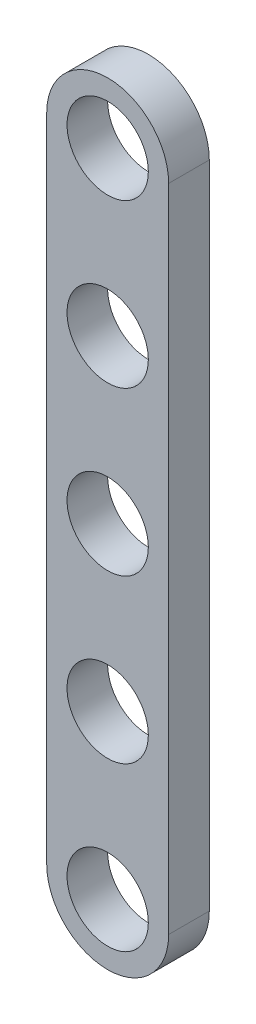
ISO-10303-21;
HEADER;
FILE_DESCRIPTION(('STEP AP214'),'2;1');
FILE_NAME('part.step','',(''),(''),'','','');
FILE_SCHEMA(('AUTOMOTIVE_DESIGN { 1 0 10303 214 1 1 1 1 }'));
ENDSEC;
DATA;
#1=APPLICATION_CONTEXT('core data for automotive mechanical design processes');
#2=APPLICATION_PROTOCOL_DEFINITION('international standard','automotive_design',2000,#1);
#3=PRODUCT_CONTEXT('',#1,'mechanical');
#4=PRODUCT('Part','Part','',(#3));
#5=PRODUCT_RELATED_PRODUCT_CATEGORY('part','',(#4));
#6=PRODUCT_DEFINITION_FORMATION('','',#4);
#7=PRODUCT_DEFINITION_CONTEXT('part definition',#1,'design');
#8=PRODUCT_DEFINITION('design','',#6,#7);
#9=PRODUCT_DEFINITION_SHAPE('','',#8);
#10=(LENGTH_UNIT() NAMED_UNIT(*) SI_UNIT(.MILLI.,.METRE.));
#11=(NAMED_UNIT(*) PLANE_ANGLE_UNIT() SI_UNIT($,.RADIAN.));
#12=(NAMED_UNIT(*) SI_UNIT($,.STERADIAN.) SOLID_ANGLE_UNIT());
#13=UNCERTAINTY_MEASURE_WITH_UNIT(LENGTH_MEASURE(1.E-05),#10,'distance_accuracy_value','');
#14=(GEOMETRIC_REPRESENTATION_CONTEXT(3) GLOBAL_UNCERTAINTY_ASSIGNED_CONTEXT((#13)) GLOBAL_UNIT_ASSIGNED_CONTEXT((#10,
#11,#12)) REPRESENTATION_CONTEXT('',''));
#15=CARTESIAN_POINT('',(0.,0.,0.));
#16=DIRECTION('',(0.,0.,1.));
#17=DIRECTION('',(1.,0.,0.));
#18=AXIS2_PLACEMENT_3D('',#15,#16,#17);
#19=CARTESIAN_POINT('',(0.,0.,1.));
#20=DIRECTION('',(0.,0.,1.));
#21=DIRECTION('',(1.,0.,0.));
#22=AXIS2_PLACEMENT_3D('',#19,#20,#21);
#23=PLANE('',#22);
#24=CARTESIAN_POINT('',(0.,0.,1.));
#25=DIRECTION('',(0.,0.,1.));
#26=DIRECTION('',(1.,0.,0.));
#27=AXIS2_PLACEMENT_3D('',#24,#25,#26);
#28=CIRCLE('',#27,1.);
#29=CARTESIAN_POINT('',(1.,0.,1.));
#30=VERTEX_POINT('',#29);
#31=EDGE_CURVE('E128',#30,#30,#28,.T.);
#32=ORIENTED_EDGE('',*,*,#31,.F.);
#33=EDGE_LOOP('',(#32));
#34=FACE_BOUND('',#33,.T.);
#35=CARTESIAN_POINT('',(0.,8.,1.));
#36=DIRECTION('',(0.,0.,1.));
#37=DIRECTION('',(1.,0.,0.));
#38=AXIS2_PLACEMENT_3D('',#35,#36,#37);
#39=CIRCLE('',#38,1.);
#40=CARTESIAN_POINT('',(1.,8.,1.));
#41=VERTEX_POINT('',#40);
#42=EDGE_CURVE('E116',#41,#41,#39,.T.);
#43=ORIENTED_EDGE('',*,*,#42,.F.);
#44=EDGE_LOOP('',(#43));
#45=FACE_BOUND('',#44,.T.);
#46=CARTESIAN_POINT('',(0.,0.,1.));
#47=DIRECTION('',(0.,0.,1.));
#48=DIRECTION('',(1.,0.,0.));
#49=AXIS2_PLACEMENT_3D('',#46,#47,#48);
#50=CIRCLE('',#49,1.5);
#51=CARTESIAN_POINT('',(-1.5,0.,1.));
#52=VERTEX_POINT('',#51);
#53=CARTESIAN_POINT('',(1.5,0.,1.));
#54=VERTEX_POINT('',#53);
#55=EDGE_CURVE('E86',#52,#54,#50,.T.);
#56=ORIENTED_EDGE('',*,*,#55,.T.);
#57=DIRECTION('',(0.,1.,0.));
#58=VECTOR('',#57,1.);
#59=CARTESIAN_POINT('',(1.5,0.,1.));
#60=LINE('',#59,#58);
#61=CARTESIAN_POINT('',(1.5,16.,1.));
#62=VERTEX_POINT('',#61);
#63=EDGE_CURVE('E81',#54,#62,#60,.T.);
#64=ORIENTED_EDGE('',*,*,#63,.T.);
#65=CARTESIAN_POINT('',(0.,16.,1.));
#66=DIRECTION('',(0.,0.,1.));
#67=DIRECTION('',(1.,0.,0.));
#68=AXIS2_PLACEMENT_3D('',#65,#66,#67);
#69=CIRCLE('',#68,1.5);
#70=CARTESIAN_POINT('',(-1.5,16.,1.));
#71=VERTEX_POINT('',#70);
#72=EDGE_CURVE('E84',#62,#71,#69,.T.);
#73=ORIENTED_EDGE('',*,*,#72,.T.);
#74=DIRECTION('',(0.,-1.,0.));
#75=VECTOR('',#74,1.);
#76=CARTESIAN_POINT('',(-1.5,0.,1.));
#77=LINE('',#76,#75);
#78=EDGE_CURVE('E51',#71,#52,#77,.T.);
#79=ORIENTED_EDGE('',*,*,#78,.T.);
#80=EDGE_LOOP('',(#56,#64,#73,#79));
#81=FACE_BOUND('',#80,.T.);
#82=CARTESIAN_POINT('',(0.,16.,1.));
#83=DIRECTION('',(0.,0.,1.));
#84=DIRECTION('',(1.,0.,0.));
#85=AXIS2_PLACEMENT_3D('',#82,#83,#84);
#86=CIRCLE('',#85,1.);
#87=CARTESIAN_POINT('',(1.,16.,1.));
#88=VERTEX_POINT('',#87);
#89=EDGE_CURVE('E101',#88,#88,#86,.T.);
#90=ORIENTED_EDGE('',*,*,#89,.F.);
#91=EDGE_LOOP('',(#90));
#92=FACE_BOUND('',#91,.T.);
#93=CARTESIAN_POINT('',(0.,12.,1.));
#94=DIRECTION('',(0.,0.,1.));
#95=DIRECTION('',(1.,0.,0.));
#96=AXIS2_PLACEMENT_3D('',#93,#94,#95);
#97=CIRCLE('',#96,1.);
#98=CARTESIAN_POINT('',(1.,12.,1.));
#99=VERTEX_POINT('',#98);
#100=EDGE_CURVE('E122',#99,#99,#97,.T.);
#101=ORIENTED_EDGE('',*,*,#100,.F.);
#102=EDGE_LOOP('',(#101));
#103=FACE_BOUND('',#102,.T.);
#104=CARTESIAN_POINT('',(0.,4.,1.));
#105=DIRECTION('',(0.,0.,1.));
#106=DIRECTION('',(1.,0.,0.));
#107=AXIS2_PLACEMENT_3D('',#104,#105,#106);
#108=CIRCLE('',#107,1.);
#109=CARTESIAN_POINT('',(1.,4.,1.));
#110=VERTEX_POINT('',#109);
#111=EDGE_CURVE('E134',#110,#110,#108,.T.);
#112=ORIENTED_EDGE('',*,*,#111,.F.);
#113=EDGE_LOOP('',(#112));
#114=FACE_BOUND('',#113,.T.);
#115=ADVANCED_FACE('F34',(#34,#45,#81,#92,#103,#114),#23,.T.);
#116=CARTESIAN_POINT('',(0.,0.,0.));
#117=DIRECTION('',(0.,0.,1.));
#118=DIRECTION('',(1.,0.,0.));
#119=AXIS2_PLACEMENT_3D('',#116,#117,#118);
#120=PLANE('',#119);
#121=CARTESIAN_POINT('',(0.,0.,0.));
#122=DIRECTION('',(0.,0.,1.));
#123=DIRECTION('',(1.,0.,0.));
#124=AXIS2_PLACEMENT_3D('',#121,#122,#123);
#125=CIRCLE('',#124,1.5);
#126=CARTESIAN_POINT('',(-1.5,0.,0.));
#127=VERTEX_POINT('',#126);
#128=CARTESIAN_POINT('',(1.5,0.,0.));
#129=VERTEX_POINT('',#128);
#130=EDGE_CURVE('E98',#127,#129,#125,.T.);
#131=ORIENTED_EDGE('',*,*,#130,.F.);
#132=DIRECTION('',(0.,-1.,0.));
#133=VECTOR('',#132,1.);
#134=CARTESIAN_POINT('',(-1.5,0.,0.));
#135=LINE('',#134,#133);
#136=CARTESIAN_POINT('',(-1.5,16.,0.));
#137=VERTEX_POINT('',#136);
#138=EDGE_CURVE('E74',#137,#127,#135,.T.);
#139=ORIENTED_EDGE('',*,*,#138,.F.);
#140=CARTESIAN_POINT('',(0.,16.,0.));
#141=DIRECTION('',(0.,0.,1.));
#142=DIRECTION('',(1.,0.,0.));
#143=AXIS2_PLACEMENT_3D('',#140,#141,#142);
#144=CIRCLE('',#143,1.5);
#145=CARTESIAN_POINT('',(1.5,16.,0.));
#146=VERTEX_POINT('',#145);
#147=EDGE_CURVE('E68',#146,#137,#144,.T.);
#148=ORIENTED_EDGE('',*,*,#147,.F.);
#149=DIRECTION('',(0.,1.,0.));
#150=VECTOR('',#149,1.);
#151=CARTESIAN_POINT('',(1.5,0.,0.));
#152=LINE('',#151,#150);
#153=EDGE_CURVE('E90',#129,#146,#152,.T.);
#154=ORIENTED_EDGE('',*,*,#153,.F.);
#155=EDGE_LOOP('',(#131,#139,#148,#154));
#156=FACE_BOUND('',#155,.T.);
#157=CARTESIAN_POINT('',(0.,16.,0.));
#158=DIRECTION('',(0.,0.,1.));
#159=DIRECTION('',(1.,0.,0.));
#160=AXIS2_PLACEMENT_3D('',#157,#158,#159);
#161=CIRCLE('',#160,1.);
#162=CARTESIAN_POINT('',(1.,16.,0.));
#163=VERTEX_POINT('',#162);
#164=EDGE_CURVE('E113',#163,#163,#161,.T.);
#165=ORIENTED_EDGE('',*,*,#164,.T.);
#166=EDGE_LOOP('',(#165));
#167=FACE_BOUND('',#166,.T.);
#168=CARTESIAN_POINT('',(0.,8.,0.));
#169=DIRECTION('',(0.,0.,1.));
#170=DIRECTION('',(1.,0.,0.));
#171=AXIS2_PLACEMENT_3D('',#168,#169,#170);
#172=CIRCLE('',#171,1.);
#173=CARTESIAN_POINT('',(1.,8.,0.));
#174=VERTEX_POINT('',#173);
#175=EDGE_CURVE('E119',#174,#174,#172,.T.);
#176=ORIENTED_EDGE('',*,*,#175,.T.);
#177=EDGE_LOOP('',(#176));
#178=FACE_BOUND('',#177,.T.);
#179=CARTESIAN_POINT('',(0.,12.,0.));
#180=DIRECTION('',(0.,0.,1.));
#181=DIRECTION('',(1.,0.,0.));
#182=AXIS2_PLACEMENT_3D('',#179,#180,#181);
#183=CIRCLE('',#182,1.);
#184=CARTESIAN_POINT('',(1.,12.,0.));
#185=VERTEX_POINT('',#184);
#186=EDGE_CURVE('E125',#185,#185,#183,.T.);
#187=ORIENTED_EDGE('',*,*,#186,.T.);
#188=EDGE_LOOP('',(#187));
#189=FACE_BOUND('',#188,.T.);
#190=CARTESIAN_POINT('',(0.,0.,0.));
#191=DIRECTION('',(0.,0.,1.));
#192=DIRECTION('',(1.,0.,0.));
#193=AXIS2_PLACEMENT_3D('',#190,#191,#192);
#194=CIRCLE('',#193,1.);
#195=CARTESIAN_POINT('',(1.,0.,0.));
#196=VERTEX_POINT('',#195);
#197=EDGE_CURVE('E131',#196,#196,#194,.T.);
#198=ORIENTED_EDGE('',*,*,#197,.T.);
#199=EDGE_LOOP('',(#198));
#200=FACE_BOUND('',#199,.T.);
#201=CARTESIAN_POINT('',(0.,4.,0.));
#202=DIRECTION('',(0.,0.,1.));
#203=DIRECTION('',(1.,0.,0.));
#204=AXIS2_PLACEMENT_3D('',#201,#202,#203);
#205=CIRCLE('',#204,1.);
#206=CARTESIAN_POINT('',(1.,4.,0.));
#207=VERTEX_POINT('',#206);
#208=EDGE_CURVE('E137',#207,#207,#205,.T.);
#209=ORIENTED_EDGE('',*,*,#208,.T.);
#210=EDGE_LOOP('',(#209));
#211=FACE_BOUND('',#210,.T.);
#212=ADVANCED_FACE('F109',(#156,#167,#178,#189,#200,#211),#120,.F.);
#213=CARTESIAN_POINT('',(0.,0.,1.));
#214=DIRECTION('',(0.,0.,-1.));
#215=DIRECTION('',(-1.,0.,0.));
#216=AXIS2_PLACEMENT_3D('',#213,#214,#215);
#217=CYLINDRICAL_SURFACE('',#216,1.5);
#218=ORIENTED_EDGE('',*,*,#130,.T.);
#219=DIRECTION('',(0.,0.,-1.));
#220=VECTOR('',#219,1.);
#221=CARTESIAN_POINT('',(1.5,0.,1.));
#222=LINE('',#221,#220);
#223=EDGE_CURVE('E11',#54,#129,#222,.T.);
#224=ORIENTED_EDGE('',*,*,#223,.F.);
#225=ORIENTED_EDGE('',*,*,#55,.F.);
#226=DIRECTION('',(0.,0.,-1.));
#227=VECTOR('',#226,1.);
#228=CARTESIAN_POINT('',(-1.5,0.,1.));
#229=LINE('',#228,#227);
#230=EDGE_CURVE('E94',#52,#127,#229,.T.);
#231=ORIENTED_EDGE('',*,*,#230,.T.);
#232=EDGE_LOOP('',(#218,#224,#225,#231));
#233=FACE_BOUND('',#232,.T.);
#234=ADVANCED_FACE('F36',(#233),#217,.T.);
#235=CARTESIAN_POINT('',(1.5,0.,1.));
#236=DIRECTION('',(-1.,0.,0.));
#237=DIRECTION('',(0.,0.,1.));
#238=AXIS2_PLACEMENT_3D('',#235,#236,#237);
#239=PLANE('',#238);
#240=ORIENTED_EDGE('',*,*,#153,.T.);
#241=DIRECTION('',(0.,0.,-1.));
#242=VECTOR('',#241,1.);
#243=CARTESIAN_POINT('',(1.5,16.,1.));
#244=LINE('',#243,#242);
#245=EDGE_CURVE('E43',#62,#146,#244,.T.);
#246=ORIENTED_EDGE('',*,*,#245,.F.);
#247=ORIENTED_EDGE('',*,*,#63,.F.);
#248=ORIENTED_EDGE('',*,*,#223,.T.);
#249=EDGE_LOOP('',(#240,#246,#247,#248));
#250=FACE_BOUND('',#249,.T.);
#251=ADVANCED_FACE('F89',(#250),#239,.F.);
#252=CARTESIAN_POINT('',(0.,16.,1.));
#253=DIRECTION('',(0.,0.,-1.));
#254=DIRECTION('',(-1.,0.,0.));
#255=AXIS2_PLACEMENT_3D('',#252,#253,#254);
#256=CYLINDRICAL_SURFACE('',#255,1.5);
#257=ORIENTED_EDGE('',*,*,#147,.T.);
#258=DIRECTION('',(0.,0.,-1.));
#259=VECTOR('',#258,1.);
#260=CARTESIAN_POINT('',(-1.5,16.,1.));
#261=LINE('',#260,#259);
#262=EDGE_CURVE('E91',#71,#137,#261,.T.);
#263=ORIENTED_EDGE('',*,*,#262,.F.);
#264=ORIENTED_EDGE('',*,*,#72,.F.);
#265=ORIENTED_EDGE('',*,*,#245,.T.);
#266=EDGE_LOOP('',(#257,#263,#264,#265));
#267=FACE_BOUND('',#266,.T.);
#268=ADVANCED_FACE('F92',(#267),#256,.T.);
#269=CARTESIAN_POINT('',(-1.5,0.,1.));
#270=DIRECTION('',(1.,0.,0.));
#271=DIRECTION('',(0.,0.,-1.));
#272=AXIS2_PLACEMENT_3D('',#269,#270,#271);
#273=PLANE('',#272);
#274=ORIENTED_EDGE('',*,*,#138,.T.);
#275=ORIENTED_EDGE('',*,*,#230,.F.);
#276=ORIENTED_EDGE('',*,*,#78,.F.);
#277=ORIENTED_EDGE('',*,*,#262,.T.);
#278=EDGE_LOOP('',(#274,#275,#276,#277));
#279=FACE_BOUND('',#278,.T.);
#280=ADVANCED_FACE('F106',(#279),#273,.F.);
#281=CARTESIAN_POINT('',(0.,16.,1.));
#282=DIRECTION('',(0.,0.,-1.));
#283=DIRECTION('',(-1.,0.,0.));
#284=AXIS2_PLACEMENT_3D('',#281,#282,#283);
#285=CYLINDRICAL_SURFACE('',#284,1.);
#286=ORIENTED_EDGE('',*,*,#89,.T.);
#287=EDGE_LOOP('',(#286));
#288=FACE_BOUND('',#287,.T.);
#289=ORIENTED_EDGE('',*,*,#164,.F.);
#290=EDGE_LOOP('',(#289));
#291=FACE_BOUND('',#290,.T.);
#292=ADVANCED_FACE('F156',(#288,#291),#285,.F.);
#293=CARTESIAN_POINT('',(0.,8.,1.));
#294=DIRECTION('',(0.,0.,-1.));
#295=DIRECTION('',(-1.,0.,0.));
#296=AXIS2_PLACEMENT_3D('',#293,#294,#295);
#297=CYLINDRICAL_SURFACE('',#296,1.);
#298=ORIENTED_EDGE('',*,*,#42,.T.);
#299=EDGE_LOOP('',(#298));
#300=FACE_BOUND('',#299,.T.);
#301=ORIENTED_EDGE('',*,*,#175,.F.);
#302=EDGE_LOOP('',(#301));
#303=FACE_BOUND('',#302,.T.);
#304=ADVANCED_FACE('F202',(#300,#303),#297,.F.);
#305=CARTESIAN_POINT('',(0.,12.,1.));
#306=DIRECTION('',(0.,0.,-1.));
#307=DIRECTION('',(-1.,0.,0.));
#308=AXIS2_PLACEMENT_3D('',#305,#306,#307);
#309=CYLINDRICAL_SURFACE('',#308,1.);
#310=ORIENTED_EDGE('',*,*,#100,.T.);
#311=EDGE_LOOP('',(#310));
#312=FACE_BOUND('',#311,.T.);
#313=ORIENTED_EDGE('',*,*,#186,.F.);
#314=EDGE_LOOP('',(#313));
#315=FACE_BOUND('',#314,.T.);
#316=ADVANCED_FACE('F210',(#312,#315),#309,.F.);
#317=CARTESIAN_POINT('',(0.,0.,1.));
#318=DIRECTION('',(0.,0.,-1.));
#319=DIRECTION('',(-1.,0.,0.));
#320=AXIS2_PLACEMENT_3D('',#317,#318,#319);
#321=CYLINDRICAL_SURFACE('',#320,1.);
#322=ORIENTED_EDGE('',*,*,#31,.T.);
#323=EDGE_LOOP('',(#322));
#324=FACE_BOUND('',#323,.T.);
#325=ORIENTED_EDGE('',*,*,#197,.F.);
#326=EDGE_LOOP('',(#325));
#327=FACE_BOUND('',#326,.T.);
#328=ADVANCED_FACE('F218',(#324,#327),#321,.F.);
#329=CARTESIAN_POINT('',(0.,4.,1.));
#330=DIRECTION('',(0.,0.,-1.));
#331=DIRECTION('',(-1.,0.,0.));
#332=AXIS2_PLACEMENT_3D('',#329,#330,#331);
#333=CYLINDRICAL_SURFACE('',#332,1.);
#334=ORIENTED_EDGE('',*,*,#111,.T.);
#335=EDGE_LOOP('',(#334));
#336=FACE_BOUND('',#335,.T.);
#337=ORIENTED_EDGE('',*,*,#208,.F.);
#338=EDGE_LOOP('',(#337));
#339=FACE_BOUND('',#338,.T.);
#340=ADVANCED_FACE('F143',(#336,#339),#333,.F.);
#341=CLOSED_SHELL('',(#115,#212,#234,#251,#268,#280,#292,#304,#316,#328,#340));
#342=MANIFOLD_SOLID_BREP('B2',#341);
#343=ADVANCED_BREP_SHAPE_REPRESENTATION('',(#18,#342),#14);
#344=SHAPE_DEFINITION_REPRESENTATION(#9,#343);
ENDSEC;
END-ISO-10303-21;
